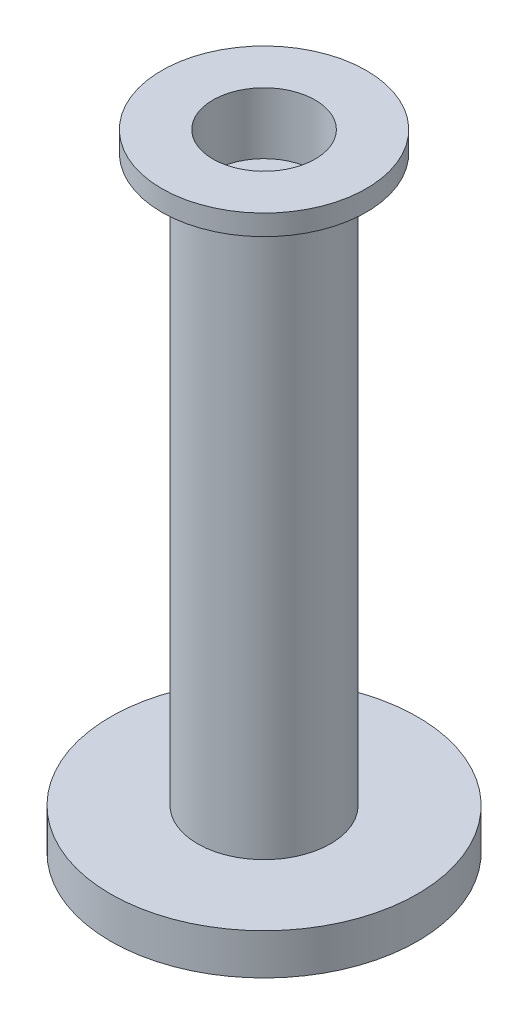
ISO-10303-21;
HEADER;
FILE_DESCRIPTION(('STEP AP214'),'2;1');
FILE_NAME('part.step','',(''),(''),'','','');
FILE_SCHEMA(('AUTOMOTIVE_DESIGN { 1 0 10303 214 1 1 1 1 }'));
ENDSEC;
DATA;
#1=APPLICATION_CONTEXT('core data for automotive mechanical design processes');
#2=APPLICATION_PROTOCOL_DEFINITION('international standard','automotive_design',2000,#1);
#3=PRODUCT_CONTEXT('',#1,'mechanical');
#4=PRODUCT('Part','Part','',(#3));
#5=PRODUCT_RELATED_PRODUCT_CATEGORY('part','',(#4));
#6=PRODUCT_DEFINITION_FORMATION('','',#4);
#7=PRODUCT_DEFINITION_CONTEXT('part definition',#1,'design');
#8=PRODUCT_DEFINITION('design','',#6,#7);
#9=PRODUCT_DEFINITION_SHAPE('','',#8);
#10=(LENGTH_UNIT() NAMED_UNIT(*) SI_UNIT(.MILLI.,.METRE.));
#11=(NAMED_UNIT(*) PLANE_ANGLE_UNIT() SI_UNIT($,.RADIAN.));
#12=(NAMED_UNIT(*) SI_UNIT($,.STERADIAN.) SOLID_ANGLE_UNIT());
#13=UNCERTAINTY_MEASURE_WITH_UNIT(LENGTH_MEASURE(1.E-05),#10,'distance_accuracy_value','');
#14=(GEOMETRIC_REPRESENTATION_CONTEXT(3) GLOBAL_UNCERTAINTY_ASSIGNED_CONTEXT((#13)) GLOBAL_UNIT_ASSIGNED_CONTEXT((#10,
#11,#12)) REPRESENTATION_CONTEXT('',''));
#15=CARTESIAN_POINT('',(0.,0.,0.));
#16=DIRECTION('',(0.,0.,1.));
#17=DIRECTION('',(1.,0.,0.));
#18=AXIS2_PLACEMENT_3D('',#15,#16,#17);
#19=CARTESIAN_POINT('',(0.,1.,0.));
#20=DIRECTION('',(0.,-1.,0.));
#21=DIRECTION('',(0.,0.,-1.));
#22=AXIS2_PLACEMENT_3D('',#19,#20,#21);
#23=CYLINDRICAL_SURFACE('',#22,3.75);
#24=CARTESIAN_POINT('',(0.,1.,0.));
#25=DIRECTION('',(0.,1.,0.));
#26=DIRECTION('',(0.,0.,1.));
#27=AXIS2_PLACEMENT_3D('',#24,#25,#26);
#28=CIRCLE('',#27,3.75);
#29=CARTESIAN_POINT('',(0.,1.,3.75));
#30=VERTEX_POINT('',#29);
#31=EDGE_CURVE('E51',#30,#30,#28,.T.);
#32=ORIENTED_EDGE('',*,*,#31,.F.);
#33=EDGE_LOOP('',(#32));
#34=FACE_BOUND('',#33,.T.);
#35=CARTESIAN_POINT('',(0.,0.,0.));
#36=DIRECTION('',(0.,1.,0.));
#37=DIRECTION('',(0.,0.,1.));
#38=AXIS2_PLACEMENT_3D('',#35,#36,#37);
#39=CIRCLE('',#38,3.75);
#40=CARTESIAN_POINT('',(0.,0.,3.75));
#41=VERTEX_POINT('',#40);
#42=EDGE_CURVE('E46',#41,#41,#39,.T.);
#43=ORIENTED_EDGE('',*,*,#42,.T.);
#44=EDGE_LOOP('',(#43));
#45=FACE_BOUND('',#44,.T.);
#46=ADVANCED_FACE('F43',(#34,#45),#23,.T.);
#47=CARTESIAN_POINT('',(0.,1.,0.));
#48=DIRECTION('',(0.,1.,0.));
#49=DIRECTION('',(0.,0.,1.));
#50=AXIS2_PLACEMENT_3D('',#47,#48,#49);
#51=PLANE('',#50);
#52=CARTESIAN_POINT('',(0.,1.,0.));
#53=DIRECTION('',(0.,1.,0.));
#54=DIRECTION('',(0.,0.,1.));
#55=AXIS2_PLACEMENT_3D('',#52,#53,#54);
#56=CIRCLE('',#55,1.625);
#57=CARTESIAN_POINT('',(0.,1.,1.625));
#58=VERTEX_POINT('',#57);
#59=EDGE_CURVE('E10',#58,#58,#56,.T.);
#60=ORIENTED_EDGE('',*,*,#59,.F.);
#61=EDGE_LOOP('',(#60));
#62=FACE_BOUND('',#61,.T.);
#63=ORIENTED_EDGE('',*,*,#31,.T.);
#64=EDGE_LOOP('',(#63));
#65=FACE_BOUND('',#64,.T.);
#66=ADVANCED_FACE('F109',(#62,#65),#51,.T.);
#67=CARTESIAN_POINT('',(0.,0.,0.));
#68=DIRECTION('',(0.,1.,0.));
#69=DIRECTION('',(0.,0.,1.));
#70=AXIS2_PLACEMENT_3D('',#67,#68,#69);
#71=PLANE('',#70);
#72=ORIENTED_EDGE('',*,*,#42,.F.);
#73=EDGE_LOOP('',(#72));
#74=FACE_BOUND('',#73,.T.);
#75=ADVANCED_FACE('F115',(#74),#71,.F.);
#76=CARTESIAN_POINT('',(0.,14.8,0.));
#77=DIRECTION('',(0.,-1.,0.));
#78=DIRECTION('',(0.,0.,-1.));
#79=AXIS2_PLACEMENT_3D('',#76,#77,#78);
#80=CYLINDRICAL_SURFACE('',#79,1.625);
#81=CARTESIAN_POINT('',(0.,14.8,0.));
#82=DIRECTION('',(0.,1.,0.));
#83=DIRECTION('',(0.,0.,1.));
#84=AXIS2_PLACEMENT_3D('',#81,#82,#83);
#85=CIRCLE('',#84,1.625);
#86=CARTESIAN_POINT('',(0.,14.8,1.625));
#87=VERTEX_POINT('',#86);
#88=EDGE_CURVE('E59',#87,#87,#85,.T.);
#89=ORIENTED_EDGE('',*,*,#88,.F.);
#90=EDGE_LOOP('',(#89));
#91=FACE_BOUND('',#90,.T.);
#92=ORIENTED_EDGE('',*,*,#59,.T.);
#93=EDGE_LOOP('',(#92));
#94=FACE_BOUND('',#93,.T.);
#95=ADVANCED_FACE('F99',(#91,#94),#80,.T.);
#96=CARTESIAN_POINT('',(0.,15.3,0.));
#97=DIRECTION('',(0.,-1.,0.));
#98=DIRECTION('',(0.,0.,-1.));
#99=AXIS2_PLACEMENT_3D('',#96,#97,#98);
#100=CYLINDRICAL_SURFACE('',#99,2.5);
#101=CARTESIAN_POINT('',(0.,15.3,0.));
#102=DIRECTION('',(0.,1.,0.));
#103=DIRECTION('',(0.,0.,1.));
#104=AXIS2_PLACEMENT_3D('',#101,#102,#103);
#105=CIRCLE('',#104,2.5);
#106=CARTESIAN_POINT('',(0.,15.3,2.5));
#107=VERTEX_POINT('',#106);
#108=EDGE_CURVE('E63',#107,#107,#105,.T.);
#109=ORIENTED_EDGE('',*,*,#108,.F.);
#110=EDGE_LOOP('',(#109));
#111=FACE_BOUND('',#110,.T.);
#112=CARTESIAN_POINT('',(0.,14.8,0.));
#113=DIRECTION('',(0.,1.,0.));
#114=DIRECTION('',(0.,0.,1.));
#115=AXIS2_PLACEMENT_3D('',#112,#113,#114);
#116=CIRCLE('',#115,2.5);
#117=CARTESIAN_POINT('',(0.,14.8,2.5));
#118=VERTEX_POINT('',#117);
#119=EDGE_CURVE('E64',#118,#118,#116,.T.);
#120=ORIENTED_EDGE('',*,*,#119,.T.);
#121=EDGE_LOOP('',(#120));
#122=FACE_BOUND('',#121,.T.);
#123=ADVANCED_FACE('F93',(#111,#122),#100,.T.);
#124=CARTESIAN_POINT('',(0.,15.3,0.));
#125=DIRECTION('',(0.,1.,0.));
#126=DIRECTION('',(0.,0.,1.));
#127=AXIS2_PLACEMENT_3D('',#124,#125,#126);
#128=PLANE('',#127);
#129=CARTESIAN_POINT('',(0.,15.3,0.));
#130=DIRECTION('',(0.,1.,0.));
#131=DIRECTION('',(0.,0.,1.));
#132=AXIS2_PLACEMENT_3D('',#129,#130,#131);
#133=CIRCLE('',#132,1.25);
#134=CARTESIAN_POINT('',(0.,15.3,1.25));
#135=VERTEX_POINT('',#134);
#136=EDGE_CURVE('E72',#135,#135,#133,.T.);
#137=ORIENTED_EDGE('',*,*,#136,.F.);
#138=EDGE_LOOP('',(#137));
#139=FACE_BOUND('',#138,.T.);
#140=ORIENTED_EDGE('',*,*,#108,.T.);
#141=EDGE_LOOP('',(#140));
#142=FACE_BOUND('',#141,.T.);
#143=ADVANCED_FACE('F90',(#139,#142),#128,.T.);
#144=CARTESIAN_POINT('',(0.,14.8,0.));
#145=DIRECTION('',(0.,1.,0.));
#146=DIRECTION('',(0.,0.,1.));
#147=AXIS2_PLACEMENT_3D('',#144,#145,#146);
#148=PLANE('',#147);
#149=ORIENTED_EDGE('',*,*,#88,.T.);
#150=EDGE_LOOP('',(#149));
#151=FACE_BOUND('',#150,.T.);
#152=ORIENTED_EDGE('',*,*,#119,.F.);
#153=EDGE_LOOP('',(#152));
#154=FACE_BOUND('',#153,.T.);
#155=ADVANCED_FACE('F86',(#151,#154),#148,.F.);
#156=CARTESIAN_POINT('',(0.,13.8,0.));
#157=DIRECTION('',(0.,1.,0.));
#158=DIRECTION('',(0.,0.,1.));
#159=AXIS2_PLACEMENT_3D('',#156,#157,#158);
#160=CYLINDRICAL_SURFACE('',#159,1.25);
#161=CARTESIAN_POINT('',(0.,13.8,0.));
#162=DIRECTION('',(0.,1.,0.));
#163=DIRECTION('',(0.,0.,1.));
#164=AXIS2_PLACEMENT_3D('',#161,#162,#163);
#165=CIRCLE('',#164,1.25);
#166=CARTESIAN_POINT('',(0.,13.8,1.25));
#167=VERTEX_POINT('',#166);
#168=EDGE_CURVE('E68',#167,#167,#165,.T.);
#169=ORIENTED_EDGE('',*,*,#168,.F.);
#170=EDGE_LOOP('',(#169));
#171=FACE_BOUND('',#170,.T.);
#172=ORIENTED_EDGE('',*,*,#136,.T.);
#173=EDGE_LOOP('',(#172));
#174=FACE_BOUND('',#173,.T.);
#175=ADVANCED_FACE('F83',(#171,#174),#160,.F.);
#176=CARTESIAN_POINT('',(0.,13.8,0.));
#177=DIRECTION('',(0.,1.,0.));
#178=DIRECTION('',(0.,0.,1.));
#179=AXIS2_PLACEMENT_3D('',#176,#177,#178);
#180=PLANE('',#179);
#181=ORIENTED_EDGE('',*,*,#168,.T.);
#182=EDGE_LOOP('',(#181));
#183=FACE_BOUND('',#182,.T.);
#184=ADVANCED_FACE('F81',(#183),#180,.T.);
#185=CLOSED_SHELL('',(#46,#66,#75,#95,#123,#143,#155,#175,#184));
#186=MANIFOLD_SOLID_BREP('B2',#185);
#187=ADVANCED_BREP_SHAPE_REPRESENTATION('',(#18,#186),#14);
#188=SHAPE_DEFINITION_REPRESENTATION(#9,#187);
ENDSEC;
END-ISO-10303-21;
